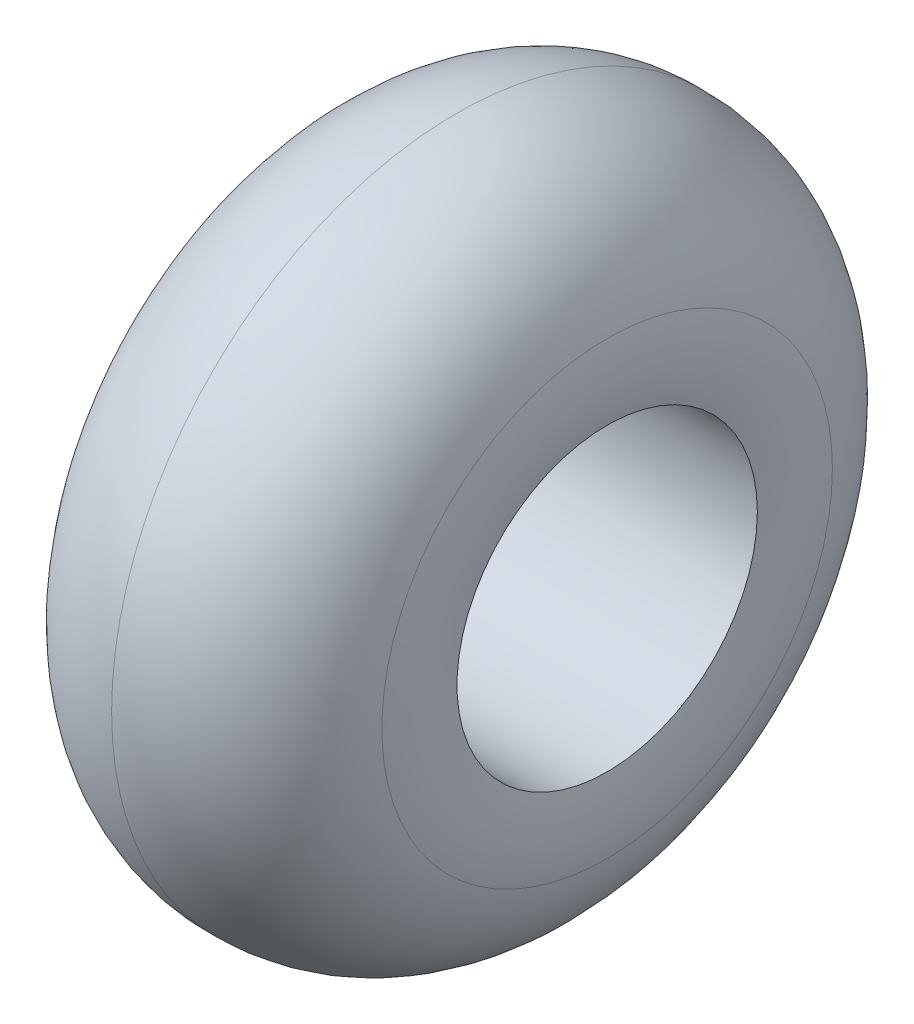
ISO-10303-21;
HEADER;
FILE_DESCRIPTION(('STEP AP214'),'2;1');
FILE_NAME('part.step','',(''),(''),'','','');
FILE_SCHEMA(('AUTOMOTIVE_DESIGN { 1 0 10303 214 1 1 1 1 }'));
ENDSEC;
DATA;
#1=APPLICATION_CONTEXT('core data for automotive mechanical design processes');
#2=APPLICATION_PROTOCOL_DEFINITION('international standard','automotive_design',2000,#1);
#3=PRODUCT_CONTEXT('',#1,'mechanical');
#4=PRODUCT('Part','Part','',(#3));
#5=PRODUCT_RELATED_PRODUCT_CATEGORY('part','',(#4));
#6=PRODUCT_DEFINITION_FORMATION('','',#4);
#7=PRODUCT_DEFINITION_CONTEXT('part definition',#1,'design');
#8=PRODUCT_DEFINITION('design','',#6,#7);
#9=PRODUCT_DEFINITION_SHAPE('','',#8);
#10=(LENGTH_UNIT() NAMED_UNIT(*) SI_UNIT(.MILLI.,.METRE.));
#11=(NAMED_UNIT(*) PLANE_ANGLE_UNIT() SI_UNIT($,.RADIAN.));
#12=(NAMED_UNIT(*) SI_UNIT($,.STERADIAN.) SOLID_ANGLE_UNIT());
#13=UNCERTAINTY_MEASURE_WITH_UNIT(LENGTH_MEASURE(1.E-05),#10,'distance_accuracy_value','');
#14=(GEOMETRIC_REPRESENTATION_CONTEXT(3) GLOBAL_UNCERTAINTY_ASSIGNED_CONTEXT((#13)) GLOBAL_UNIT_ASSIGNED_CONTEXT((#10,
#11,#12)) REPRESENTATION_CONTEXT('',''));
#15=CARTESIAN_POINT('',(0.,0.,0.));
#16=DIRECTION('',(0.,0.,1.));
#17=DIRECTION('',(1.,0.,0.));
#18=AXIS2_PLACEMENT_3D('',#15,#16,#17);
#19=CARTESIAN_POINT('',(-1.28032695269351,0.,0.));
#20=DIRECTION('',(1.,0.,0.));
#21=DIRECTION('',(0.,0.,-1.));
#22=AXIS2_PLACEMENT_3D('',#19,#20,#21);
#23=TOROIDAL_SURFACE('',#22,82.5629086908669,63.5);
#24=CARTESIAN_POINT('',(-63.5,0.,0.));
#25=DIRECTION('',(1.,0.,0.));
#26=DIRECTION('',(0.,0.,-1.));
#27=AXIS2_PLACEMENT_3D('',#24,#25,#26);
#28=CIRCLE('',#27,95.25);
#29=CARTESIAN_POINT('',(-63.5,0.,-95.25));
#30=VERTEX_POINT('',#29);
#31=EDGE_CURVE('E10',#30,#30,#28,.T.);
#32=ORIENTED_EDGE('',*,*,#31,.T.);
#33=EDGE_LOOP('',(#32));
#34=FACE_BOUND('',#33,.T.);
#35=CARTESIAN_POINT('',(0.,0.,0.));
#36=DIRECTION('',(1.,0.,0.));
#37=DIRECTION('',(0.,0.,-1.));
#38=AXIS2_PLACEMENT_3D('',#35,#36,#37);
#39=CIRCLE('',#38,146.05);
#40=CARTESIAN_POINT('',(0.,0.,-146.05));
#41=VERTEX_POINT('',#40);
#42=EDGE_CURVE('E62',#41,#41,#39,.T.);
#43=ORIENTED_EDGE('',*,*,#42,.F.);
#44=EDGE_LOOP('',(#43));
#45=FACE_BOUND('',#44,.T.);
#46=ADVANCED_FACE('F39',(#34,#45),#23,.T.);
#47=CARTESIAN_POINT('',(11.0280106738399,0.,0.));
#48=DIRECTION('',(1.,0.,0.));
#49=DIRECTION('',(0.,0.,-1.));
#50=AXIS2_PLACEMENT_3D('',#47,#48,#49);
#51=TOROIDAL_SURFACE('',#50,79.375,76.2);
#52=CARTESIAN_POINT('',(-63.5,0.,0.));
#53=DIRECTION('',(1.,0.,0.));
#54=DIRECTION('',(0.,0.,-1.));
#55=AXIS2_PLACEMENT_3D('',#52,#53,#54);
#56=CIRCLE('',#55,63.5);
#57=CARTESIAN_POINT('',(-63.5,0.,-63.5));
#58=VERTEX_POINT('',#57);
#59=EDGE_CURVE('E46',#58,#58,#56,.T.);
#60=ORIENTED_EDGE('',*,*,#59,.T.);
#61=EDGE_LOOP('',(#60));
#62=FACE_BOUND('',#61,.T.);
#63=ORIENTED_EDGE('',*,*,#31,.F.);
#64=EDGE_LOOP('',(#63));
#65=FACE_BOUND('',#64,.T.);
#66=ADVANCED_FACE('F70',(#62,#65),#51,.T.);
#67=CARTESIAN_POINT('',(0.,0.,0.));
#68=DIRECTION('',(1.,0.,0.));
#69=DIRECTION('',(0.,0.,-1.));
#70=AXIS2_PLACEMENT_3D('',#67,#68,#69);
#71=CYLINDRICAL_SURFACE('',#70,63.5);
#72=CARTESIAN_POINT('',(63.5,0.,0.));
#73=DIRECTION('',(1.,0.,0.));
#74=DIRECTION('',(0.,0.,-1.));
#75=AXIS2_PLACEMENT_3D('',#72,#73,#74);
#76=CIRCLE('',#75,63.5000000000001);
#77=CARTESIAN_POINT('',(63.5,0.,-63.5000000000001));
#78=VERTEX_POINT('',#77);
#79=EDGE_CURVE('E51',#78,#78,#76,.T.);
#80=ORIENTED_EDGE('',*,*,#79,.T.);
#81=EDGE_LOOP('',(#80));
#82=FACE_BOUND('',#81,.T.);
#83=ORIENTED_EDGE('',*,*,#59,.F.);
#84=EDGE_LOOP('',(#83));
#85=FACE_BOUND('',#84,.T.);
#86=ADVANCED_FACE('F74',(#82,#85),#71,.F.);
#87=CARTESIAN_POINT('',(-11.0280106738399,0.,0.));
#88=DIRECTION('',(1.,0.,0.));
#89=DIRECTION('',(0.,0.,-1.));
#90=AXIS2_PLACEMENT_3D('',#87,#88,#89);
#91=TOROIDAL_SURFACE('',#90,79.375,76.2);
#92=ORIENTED_EDGE('',*,*,#79,.F.);
#93=EDGE_LOOP('',(#92));
#94=FACE_BOUND('',#93,.T.);
#95=CARTESIAN_POINT('',(63.5,0.,0.));
#96=DIRECTION('',(1.,0.,0.));
#97=DIRECTION('',(0.,0.,-1.));
#98=AXIS2_PLACEMENT_3D('',#95,#96,#97);
#99=CIRCLE('',#98,95.25);
#100=CARTESIAN_POINT('',(63.5,0.,-95.25));
#101=VERTEX_POINT('',#100);
#102=EDGE_CURVE('E56',#101,#101,#99,.T.);
#103=ORIENTED_EDGE('',*,*,#102,.T.);
#104=EDGE_LOOP('',(#103));
#105=FACE_BOUND('',#104,.T.);
#106=ADVANCED_FACE('F78',(#94,#105),#91,.T.);
#107=CARTESIAN_POINT('',(1.28032695269352,0.,0.));
#108=DIRECTION('',(1.,0.,0.));
#109=DIRECTION('',(0.,0.,-1.));
#110=AXIS2_PLACEMENT_3D('',#107,#108,#109);
#111=TOROIDAL_SURFACE('',#110,82.5629086908669,63.5);
#112=ORIENTED_EDGE('',*,*,#102,.F.);
#113=EDGE_LOOP('',(#112));
#114=FACE_BOUND('',#113,.T.);
#115=ORIENTED_EDGE('',*,*,#42,.T.);
#116=EDGE_LOOP('',(#115));
#117=FACE_BOUND('',#116,.T.);
#118=ADVANCED_FACE('F67',(#114,#117),#111,.T.);
#119=CLOSED_SHELL('',(#46,#66,#86,#106,#118));
#120=MANIFOLD_SOLID_BREP('B2',#119);
#121=ADVANCED_BREP_SHAPE_REPRESENTATION('',(#18,#120),#14);
#122=SHAPE_DEFINITION_REPRESENTATION(#9,#121);
ENDSEC;
END-ISO-10303-21;
